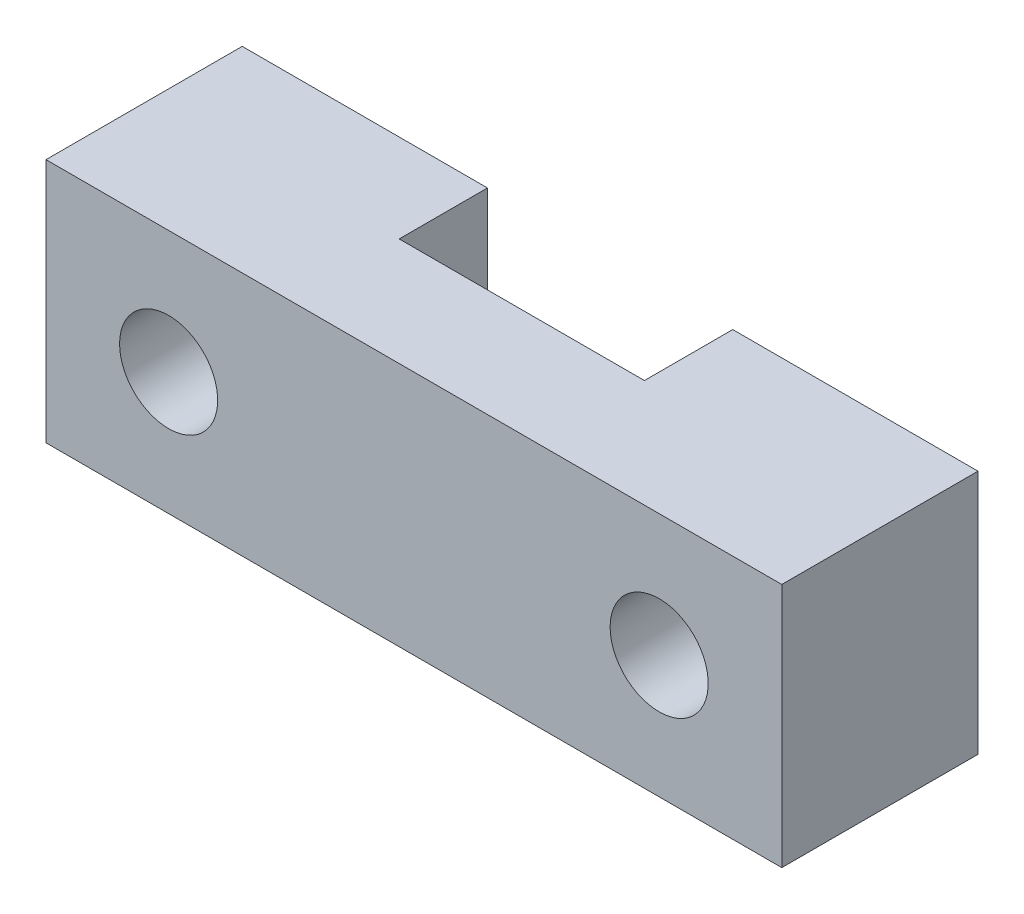
ISO-10303-21;
HEADER;
FILE_DESCRIPTION(('STEP AP214'),'2;1');
FILE_NAME('part.step','',(''),(''),'','','');
FILE_SCHEMA(('AUTOMOTIVE_DESIGN { 1 0 10303 214 1 1 1 1 }'));
ENDSEC;
DATA;
#1=APPLICATION_CONTEXT('core data for automotive mechanical design processes');
#2=APPLICATION_PROTOCOL_DEFINITION('international standard','automotive_design',2000,#1);
#3=PRODUCT_CONTEXT('',#1,'mechanical');
#4=PRODUCT('Part','Part','',(#3));
#5=PRODUCT_RELATED_PRODUCT_CATEGORY('part','',(#4));
#6=PRODUCT_DEFINITION_FORMATION('','',#4);
#7=PRODUCT_DEFINITION_CONTEXT('part definition',#1,'design');
#8=PRODUCT_DEFINITION('design','',#6,#7);
#9=PRODUCT_DEFINITION_SHAPE('','',#8);
#10=(LENGTH_UNIT() NAMED_UNIT(*) SI_UNIT(.MILLI.,.METRE.));
#11=(NAMED_UNIT(*) PLANE_ANGLE_UNIT() SI_UNIT($,.RADIAN.));
#12=(NAMED_UNIT(*) SI_UNIT($,.STERADIAN.) SOLID_ANGLE_UNIT());
#13=UNCERTAINTY_MEASURE_WITH_UNIT(LENGTH_MEASURE(1.E-05),#10,'distance_accuracy_value','');
#14=(GEOMETRIC_REPRESENTATION_CONTEXT(3) GLOBAL_UNCERTAINTY_ASSIGNED_CONTEXT((#13)) GLOBAL_UNIT_ASSIGNED_CONTEXT((#10,
#11,#12)) REPRESENTATION_CONTEXT('',''));
#15=CARTESIAN_POINT('',(0.,0.,0.));
#16=DIRECTION('',(0.,0.,1.));
#17=DIRECTION('',(1.,0.,0.));
#18=AXIS2_PLACEMENT_3D('',#15,#16,#17);
#19=CARTESIAN_POINT('',(7.5,5.,-2.));
#20=DIRECTION('',(0.,0.,1.));
#21=DIRECTION('',(1.,0.,0.));
#22=AXIS2_PLACEMENT_3D('',#19,#20,#21);
#23=PLANE('',#22);
#24=CARTESIAN_POINT('',(-5.,2.5,-2.));
#25=DIRECTION('',(0.,0.,-1.));
#26=DIRECTION('',(-1.,0.,0.));
#27=AXIS2_PLACEMENT_3D('',#24,#25,#26);
#28=CIRCLE('',#27,1.);
#29=CARTESIAN_POINT('',(-6.,2.5,-2.));
#30=VERTEX_POINT('',#29);
#31=EDGE_CURVE('E131',#30,#30,#28,.T.);
#32=ORIENTED_EDGE('',*,*,#31,.F.);
#33=EDGE_LOOP('',(#32));
#34=FACE_BOUND('',#33,.T.);
#35=DIRECTION('',(-1.,0.,0.));
#36=VECTOR('',#35,1.);
#37=CARTESIAN_POINT('',(7.5,5.,-2.));
#38=LINE('',#37,#36);
#39=CARTESIAN_POINT('',(-2.5,5.,-2.));
#40=VERTEX_POINT('',#39);
#41=CARTESIAN_POINT('',(-7.5,5.,-2.));
#42=VERTEX_POINT('',#41);
#43=EDGE_CURVE('E58',#40,#42,#38,.T.);
#44=ORIENTED_EDGE('',*,*,#43,.F.);
#45=DIRECTION('',(0.,1.,0.));
#46=VECTOR('',#45,1.);
#47=CARTESIAN_POINT('',(-2.5,0.,-2.));
#48=LINE('',#47,#46);
#49=CARTESIAN_POINT('',(-2.5,0.,-2.));
#50=VERTEX_POINT('',#49);
#51=EDGE_CURVE('E137',#50,#40,#48,.T.);
#52=ORIENTED_EDGE('',*,*,#51,.F.);
#53=DIRECTION('',(-1.,0.,0.));
#54=VECTOR('',#53,1.);
#55=CARTESIAN_POINT('',(7.5,0.,-2.));
#56=LINE('',#55,#54);
#57=CARTESIAN_POINT('',(-7.5,0.,-2.));
#58=VERTEX_POINT('',#57);
#59=EDGE_CURVE('E80',#50,#58,#56,.T.);
#60=ORIENTED_EDGE('',*,*,#59,.T.);
#61=DIRECTION('',(0.,-1.,0.));
#62=VECTOR('',#61,1.);
#63=CARTESIAN_POINT('',(-7.5,5.,-2.));
#64=LINE('',#63,#62);
#65=EDGE_CURVE('E153',#42,#58,#64,.T.);
#66=ORIENTED_EDGE('',*,*,#65,.F.);
#67=EDGE_LOOP('',(#44,#52,#60,#66));
#68=FACE_BOUND('',#67,.T.);
#69=ADVANCED_FACE('F33',(#34,#68),#23,.F.);
#70=CARTESIAN_POINT('',(-7.5,5.,-2.));
#71=DIRECTION('',(1.,0.,0.));
#72=DIRECTION('',(0.,0.,-1.));
#73=AXIS2_PLACEMENT_3D('',#70,#71,#72);
#74=PLANE('',#73);
#75=DIRECTION('',(0.,0.,1.));
#76=VECTOR('',#75,1.);
#77=CARTESIAN_POINT('',(-7.5,0.,-2.));
#78=LINE('',#77,#76);
#79=CARTESIAN_POINT('',(-7.5,0.,2.));
#80=VERTEX_POINT('',#79);
#81=EDGE_CURVE('E139',#58,#80,#78,.T.);
#82=ORIENTED_EDGE('',*,*,#81,.T.);
#83=DIRECTION('',(0.,-1.,0.));
#84=VECTOR('',#83,1.);
#85=CARTESIAN_POINT('',(-7.5,5.,2.));
#86=LINE('',#85,#84);
#87=CARTESIAN_POINT('',(-7.5,5.,2.));
#88=VERTEX_POINT('',#87);
#89=EDGE_CURVE('E11',#88,#80,#86,.T.);
#90=ORIENTED_EDGE('',*,*,#89,.F.);
#91=DIRECTION('',(0.,0.,1.));
#92=VECTOR('',#91,1.);
#93=CARTESIAN_POINT('',(-7.5,5.,-2.));
#94=LINE('',#93,#92);
#95=EDGE_CURVE('E144',#42,#88,#94,.T.);
#96=ORIENTED_EDGE('',*,*,#95,.F.);
#97=ORIENTED_EDGE('',*,*,#65,.T.);
#98=EDGE_LOOP('',(#82,#90,#96,#97));
#99=FACE_BOUND('',#98,.T.);
#100=ADVANCED_FACE('F35',(#99),#74,.F.);
#101=CARTESIAN_POINT('',(7.5,5.,2.));
#102=DIRECTION('',(0.,0.,-1.));
#103=DIRECTION('',(-1.,0.,0.));
#104=AXIS2_PLACEMENT_3D('',#101,#102,#103);
#105=PLANE('',#104);
#106=CARTESIAN_POINT('',(5.,2.5,2.));
#107=DIRECTION('',(0.,0.,-1.));
#108=DIRECTION('',(-1.,0.,0.));
#109=AXIS2_PLACEMENT_3D('',#106,#107,#108);
#110=CIRCLE('',#109,1.);
#111=CARTESIAN_POINT('',(4.,2.5,2.));
#112=VERTEX_POINT('',#111);
#113=EDGE_CURVE('E208',#112,#112,#110,.T.);
#114=ORIENTED_EDGE('',*,*,#113,.T.);
#115=EDGE_LOOP('',(#114));
#116=FACE_BOUND('',#115,.T.);
#117=CARTESIAN_POINT('',(-5.,2.5,2.));
#118=DIRECTION('',(0.,0.,-1.));
#119=DIRECTION('',(-1.,0.,0.));
#120=AXIS2_PLACEMENT_3D('',#117,#118,#119);
#121=CIRCLE('',#120,1.);
#122=CARTESIAN_POINT('',(-6.,2.5,2.));
#123=VERTEX_POINT('',#122);
#124=EDGE_CURVE('E37',#123,#123,#121,.T.);
#125=ORIENTED_EDGE('',*,*,#124,.T.);
#126=EDGE_LOOP('',(#125));
#127=FACE_BOUND('',#126,.T.);
#128=DIRECTION('',(1.,0.,0.));
#129=VECTOR('',#128,1.);
#130=CARTESIAN_POINT('',(7.5,0.,2.));
#131=LINE('',#130,#129);
#132=CARTESIAN_POINT('',(7.5,0.,2.));
#133=VERTEX_POINT('',#132);
#134=EDGE_CURVE('E156',#80,#133,#131,.T.);
#135=ORIENTED_EDGE('',*,*,#134,.T.);
#136=DIRECTION('',(0.,-1.,0.));
#137=VECTOR('',#136,1.);
#138=CARTESIAN_POINT('',(7.5,5.,2.));
#139=LINE('',#138,#137);
#140=CARTESIAN_POINT('',(7.5,5.,2.));
#141=VERTEX_POINT('',#140);
#142=EDGE_CURVE('E42',#141,#133,#139,.T.);
#143=ORIENTED_EDGE('',*,*,#142,.F.);
#144=DIRECTION('',(1.,0.,0.));
#145=VECTOR('',#144,1.);
#146=CARTESIAN_POINT('',(7.5,5.,2.));
#147=LINE('',#146,#145);
#148=EDGE_CURVE('E87',#88,#141,#147,.T.);
#149=ORIENTED_EDGE('',*,*,#148,.F.);
#150=ORIENTED_EDGE('',*,*,#89,.T.);
#151=EDGE_LOOP('',(#135,#143,#149,#150));
#152=FACE_BOUND('',#151,.T.);
#153=ADVANCED_FACE('F181',(#116,#127,#152),#105,.F.);
#154=CARTESIAN_POINT('',(7.5,5.,-2.));
#155=DIRECTION('',(-1.,0.,0.));
#156=DIRECTION('',(0.,0.,1.));
#157=AXIS2_PLACEMENT_3D('',#154,#155,#156);
#158=PLANE('',#157);
#159=DIRECTION('',(0.,0.,-1.));
#160=VECTOR('',#159,1.);
#161=CARTESIAN_POINT('',(7.5,0.,-2.));
#162=LINE('',#161,#160);
#163=CARTESIAN_POINT('',(7.5,0.,-2.));
#164=VERTEX_POINT('',#163);
#165=EDGE_CURVE('E158',#133,#164,#162,.T.);
#166=ORIENTED_EDGE('',*,*,#165,.T.);
#167=DIRECTION('',(0.,-1.,0.));
#168=VECTOR('',#167,1.);
#169=CARTESIAN_POINT('',(7.5,5.,-2.));
#170=LINE('',#169,#168);
#171=CARTESIAN_POINT('',(7.5,5.,-2.));
#172=VERTEX_POINT('',#171);
#173=EDGE_CURVE('E163',#172,#164,#170,.T.);
#174=ORIENTED_EDGE('',*,*,#173,.F.);
#175=DIRECTION('',(0.,0.,-1.));
#176=VECTOR('',#175,1.);
#177=CARTESIAN_POINT('',(7.5,5.,-2.));
#178=LINE('',#177,#176);
#179=EDGE_CURVE('E148',#141,#172,#178,.T.);
#180=ORIENTED_EDGE('',*,*,#179,.F.);
#181=ORIENTED_EDGE('',*,*,#142,.T.);
#182=EDGE_LOOP('',(#166,#174,#180,#181));
#183=FACE_BOUND('',#182,.T.);
#184=ADVANCED_FACE('F170',(#183),#158,.F.);
#185=CARTESIAN_POINT('',(5.,2.5,-2.));
#186=DIRECTION('',(0.,0.,-1.));
#187=DIRECTION('',(1.,0.,0.));
#188=AXIS2_PLACEMENT_3D('',#185,#186,#187);
#189=CIRCLE('',#188,1.);
#190=CARTESIAN_POINT('',(6.,2.5,-2.));
#191=VERTEX_POINT('',#190);
#192=EDGE_CURVE('E206',#191,#191,#189,.T.);
#193=ORIENTED_EDGE('',*,*,#192,.F.);
#194=EDGE_LOOP('',(#193));
#195=FACE_BOUND('',#194,.T.);
#196=CARTESIAN_POINT('',(2.5,0.,-2.));
#197=VERTEX_POINT('',#196);
#198=EDGE_CURVE('E146',#164,#197,#56,.T.);
#199=ORIENTED_EDGE('',*,*,#198,.T.);
#200=DIRECTION('',(0.,1.,0.));
#201=VECTOR('',#200,1.);
#202=CARTESIAN_POINT('',(2.5,0.,-2.));
#203=LINE('',#202,#201);
#204=CARTESIAN_POINT('',(2.5,5.,-2.));
#205=VERTEX_POINT('',#204);
#206=EDGE_CURVE('E140',#197,#205,#203,.T.);
#207=ORIENTED_EDGE('',*,*,#206,.T.);
#208=EDGE_CURVE('E150',#172,#205,#38,.T.);
#209=ORIENTED_EDGE('',*,*,#208,.F.);
#210=ORIENTED_EDGE('',*,*,#173,.T.);
#211=EDGE_LOOP('',(#199,#207,#209,#210));
#212=FACE_BOUND('',#211,.T.);
#213=ADVANCED_FACE('F174',(#195,#212),#23,.F.);
#214=CARTESIAN_POINT('',(0.,5.,0.));
#215=DIRECTION('',(0.,-1.,0.));
#216=DIRECTION('',(0.,0.,-1.));
#217=AXIS2_PLACEMENT_3D('',#214,#215,#216);
#218=PLANE('',#217);
#219=DIRECTION('',(1.,0.,0.));
#220=VECTOR('',#219,1.);
#221=CARTESIAN_POINT('',(-2.5,5.,-0.200000000000001));
#222=LINE('',#221,#220);
#223=CARTESIAN_POINT('',(-2.5,5.,-0.200000000000001));
#224=VERTEX_POINT('',#223);
#225=CARTESIAN_POINT('',(2.5,5.,-0.200000000000002));
#226=VERTEX_POINT('',#225);
#227=EDGE_CURVE('E128',#224,#226,#222,.T.);
#228=ORIENTED_EDGE('',*,*,#227,.F.);
#229=DIRECTION('',(0.,0.,1.));
#230=VECTOR('',#229,1.);
#231=CARTESIAN_POINT('',(-2.5,5.,-2.));
#232=LINE('',#231,#230);
#233=EDGE_CURVE('E113',#40,#224,#232,.T.);
#234=ORIENTED_EDGE('',*,*,#233,.F.);
#235=ORIENTED_EDGE('',*,*,#43,.T.);
#236=ORIENTED_EDGE('',*,*,#95,.T.);
#237=ORIENTED_EDGE('',*,*,#148,.T.);
#238=ORIENTED_EDGE('',*,*,#179,.T.);
#239=ORIENTED_EDGE('',*,*,#208,.T.);
#240=DIRECTION('',(0.,0.,-1.));
#241=VECTOR('',#240,1.);
#242=CARTESIAN_POINT('',(2.5,5.,-2.));
#243=LINE('',#242,#241);
#244=EDGE_CURVE('E126',#226,#205,#243,.T.);
#245=ORIENTED_EDGE('',*,*,#244,.F.);
#246=EDGE_LOOP('',(#228,#234,#235,#236,#237,#238,#239,#245));
#247=FACE_BOUND('',#246,.T.);
#248=ADVANCED_FACE('F177',(#247),#218,.F.);
#249=CARTESIAN_POINT('',(0.,0.,0.));
#250=DIRECTION('',(0.,-1.,0.));
#251=DIRECTION('',(0.,0.,-1.));
#252=AXIS2_PLACEMENT_3D('',#249,#250,#251);
#253=PLANE('',#252);
#254=DIRECTION('',(0.,0.,1.));
#255=VECTOR('',#254,1.);
#256=CARTESIAN_POINT('',(-2.5,0.,-2.));
#257=LINE('',#256,#255);
#258=CARTESIAN_POINT('',(-2.5,0.,-0.200000000000001));
#259=VERTEX_POINT('',#258);
#260=EDGE_CURVE('E112',#50,#259,#257,.T.);
#261=ORIENTED_EDGE('',*,*,#260,.T.);
#262=DIRECTION('',(1.,0.,0.));
#263=VECTOR('',#262,1.);
#264=CARTESIAN_POINT('',(-2.5,0.,-0.200000000000001));
#265=LINE('',#264,#263);
#266=CARTESIAN_POINT('',(2.5,0.,-0.200000000000002));
#267=VERTEX_POINT('',#266);
#268=EDGE_CURVE('E120',#259,#267,#265,.T.);
#269=ORIENTED_EDGE('',*,*,#268,.T.);
#270=DIRECTION('',(0.,0.,-1.));
#271=VECTOR('',#270,1.);
#272=CARTESIAN_POINT('',(2.5,0.,-2.));
#273=LINE('',#272,#271);
#274=EDGE_CURVE('E49',#267,#197,#273,.T.);
#275=ORIENTED_EDGE('',*,*,#274,.T.);
#276=ORIENTED_EDGE('',*,*,#198,.F.);
#277=ORIENTED_EDGE('',*,*,#165,.F.);
#278=ORIENTED_EDGE('',*,*,#134,.F.);
#279=ORIENTED_EDGE('',*,*,#81,.F.);
#280=ORIENTED_EDGE('',*,*,#59,.F.);
#281=EDGE_LOOP('',(#261,#269,#275,#276,#277,#278,#279,#280));
#282=FACE_BOUND('',#281,.T.);
#283=ADVANCED_FACE('F124',(#282),#253,.T.);
#284=CARTESIAN_POINT('',(-2.5,0.,-2.));
#285=DIRECTION('',(-1.,0.,0.));
#286=DIRECTION('',(0.,0.,1.));
#287=AXIS2_PLACEMENT_3D('',#284,#285,#286);
#288=PLANE('',#287);
#289=ORIENTED_EDGE('',*,*,#233,.T.);
#290=DIRECTION('',(0.,1.,0.));
#291=VECTOR('',#290,1.);
#292=CARTESIAN_POINT('',(-2.5,0.,-0.200000000000001));
#293=LINE('',#292,#291);
#294=EDGE_CURVE('E108',#259,#224,#293,.T.);
#295=ORIENTED_EDGE('',*,*,#294,.F.);
#296=ORIENTED_EDGE('',*,*,#260,.F.);
#297=ORIENTED_EDGE('',*,*,#51,.T.);
#298=EDGE_LOOP('',(#289,#295,#296,#297));
#299=FACE_BOUND('',#298,.T.);
#300=ADVANCED_FACE('F110',(#299),#288,.F.);
#301=CARTESIAN_POINT('',(2.5,0.,-2.));
#302=DIRECTION('',(1.,0.,0.));
#303=DIRECTION('',(0.,0.,-1.));
#304=AXIS2_PLACEMENT_3D('',#301,#302,#303);
#305=PLANE('',#304);
#306=ORIENTED_EDGE('',*,*,#244,.T.);
#307=ORIENTED_EDGE('',*,*,#206,.F.);
#308=ORIENTED_EDGE('',*,*,#274,.F.);
#309=DIRECTION('',(0.,1.,0.));
#310=VECTOR('',#309,1.);
#311=CARTESIAN_POINT('',(2.5,0.,-0.200000000000002));
#312=LINE('',#311,#310);
#313=EDGE_CURVE('E117',#267,#226,#312,.T.);
#314=ORIENTED_EDGE('',*,*,#313,.T.);
#315=EDGE_LOOP('',(#306,#307,#308,#314));
#316=FACE_BOUND('',#315,.T.);
#317=ADVANCED_FACE('F225',(#316),#305,.F.);
#318=CARTESIAN_POINT('',(-2.5,0.,-0.200000000000001));
#319=DIRECTION('',(0.,0.,1.));
#320=DIRECTION('',(1.,0.,0.));
#321=AXIS2_PLACEMENT_3D('',#318,#319,#320);
#322=PLANE('',#321);
#323=ORIENTED_EDGE('',*,*,#227,.T.);
#324=ORIENTED_EDGE('',*,*,#313,.F.);
#325=ORIENTED_EDGE('',*,*,#268,.F.);
#326=ORIENTED_EDGE('',*,*,#294,.T.);
#327=EDGE_LOOP('',(#323,#324,#325,#326));
#328=FACE_BOUND('',#327,.T.);
#329=ADVANCED_FACE('F121',(#328),#322,.F.);
#330=CARTESIAN_POINT('',(-5.,2.5,3.));
#331=DIRECTION('',(0.,0.,-1.));
#332=DIRECTION('',(-1.,0.,0.));
#333=AXIS2_PLACEMENT_3D('',#330,#331,#332);
#334=CYLINDRICAL_SURFACE('',#333,1.);
#335=ORIENTED_EDGE('',*,*,#31,.T.);
#336=EDGE_LOOP('',(#335));
#337=FACE_BOUND('',#336,.T.);
#338=ORIENTED_EDGE('',*,*,#124,.F.);
#339=EDGE_LOOP('',(#338));
#340=FACE_BOUND('',#339,.T.);
#341=ADVANCED_FACE('F216',(#337,#340),#334,.F.);
#342=CARTESIAN_POINT('',(5.,2.5,3.));
#343=DIRECTION('',(0.,0.,-1.));
#344=DIRECTION('',(-1.,0.,0.));
#345=AXIS2_PLACEMENT_3D('',#342,#343,#344);
#346=CYLINDRICAL_SURFACE('',#345,1.);
#347=ORIENTED_EDGE('',*,*,#192,.T.);
#348=EDGE_LOOP('',(#347));
#349=FACE_BOUND('',#348,.T.);
#350=ORIENTED_EDGE('',*,*,#113,.F.);
#351=EDGE_LOOP('',(#350));
#352=FACE_BOUND('',#351,.T.);
#353=ADVANCED_FACE('F218',(#349,#352),#346,.F.);
#354=CLOSED_SHELL('',(#69,#100,#153,#184,#213,#248,#283,#300,#317,#329,#341,#353));
#355=MANIFOLD_SOLID_BREP('B2',#354);
#356=ADVANCED_BREP_SHAPE_REPRESENTATION('',(#18,#355),#14);
#357=SHAPE_DEFINITION_REPRESENTATION(#9,#356);
ENDSEC;
END-ISO-10303-21;
